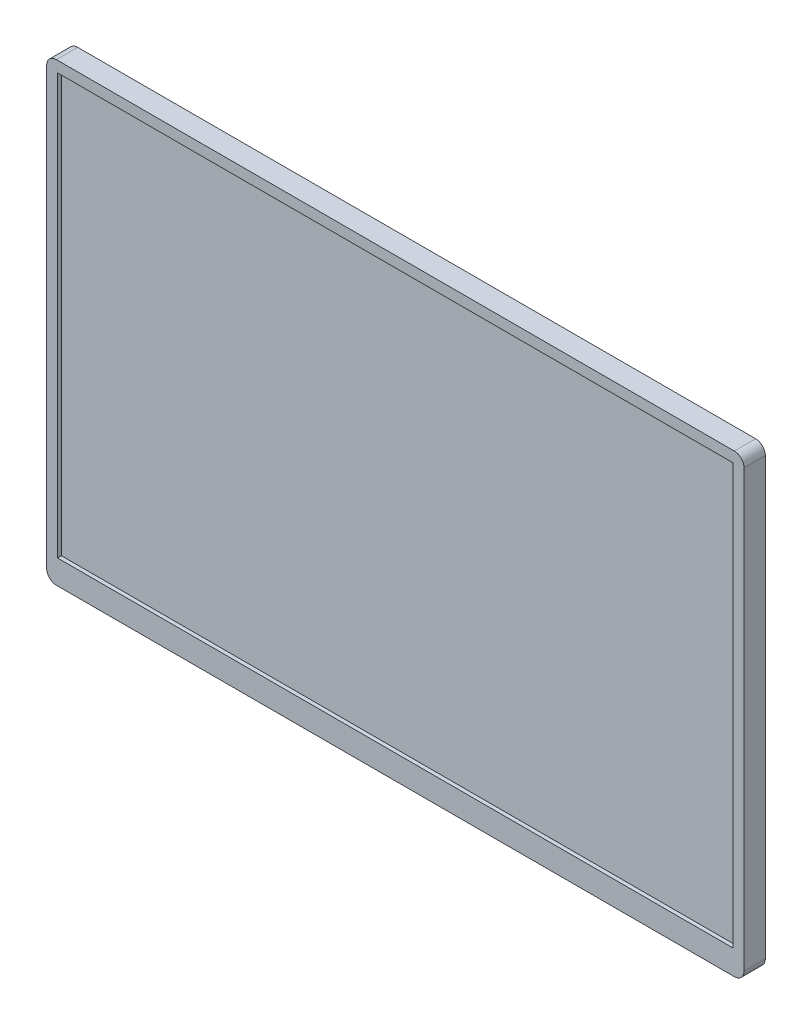
ISO-10303-21;
HEADER;
FILE_DESCRIPTION(('STEP AP214'),'2;1');
FILE_NAME('part.step','',(''),(''),'','','');
FILE_SCHEMA(('AUTOMOTIVE_DESIGN { 1 0 10303 214 1 1 1 1 }'));
ENDSEC;
DATA;
#1=APPLICATION_CONTEXT('core data for automotive mechanical design processes');
#2=APPLICATION_PROTOCOL_DEFINITION('international standard','automotive_design',2000,#1);
#3=PRODUCT_CONTEXT('',#1,'mechanical');
#4=PRODUCT('Part','Part','',(#3));
#5=PRODUCT_RELATED_PRODUCT_CATEGORY('part','',(#4));
#6=PRODUCT_DEFINITION_FORMATION('','',#4);
#7=PRODUCT_DEFINITION_CONTEXT('part definition',#1,'design');
#8=PRODUCT_DEFINITION('design','',#6,#7);
#9=PRODUCT_DEFINITION_SHAPE('','',#8);
#10=(LENGTH_UNIT() NAMED_UNIT(*) SI_UNIT(.MILLI.,.METRE.));
#11=(NAMED_UNIT(*) PLANE_ANGLE_UNIT() SI_UNIT($,.RADIAN.));
#12=(NAMED_UNIT(*) SI_UNIT($,.STERADIAN.) SOLID_ANGLE_UNIT());
#13=UNCERTAINTY_MEASURE_WITH_UNIT(LENGTH_MEASURE(1.E-05),#10,'distance_accuracy_value','');
#14=(GEOMETRIC_REPRESENTATION_CONTEXT(3) GLOBAL_UNCERTAINTY_ASSIGNED_CONTEXT((#13)) GLOBAL_UNIT_ASSIGNED_CONTEXT((#10,
#11,#12)) REPRESENTATION_CONTEXT('',''));
#15=CARTESIAN_POINT('',(0.,0.,0.));
#16=DIRECTION('',(0.,0.,1.));
#17=DIRECTION('',(1.,0.,0.));
#18=AXIS2_PLACEMENT_3D('',#15,#16,#17);
#19=CARTESIAN_POINT('',(180.,117.5,11.));
#20=DIRECTION('',(-1.,0.,0.));
#21=DIRECTION('',(0.,-1.,0.));
#22=AXIS2_PLACEMENT_3D('',#19,#20,#21);
#23=PLANE('',#22);
#24=DIRECTION('',(0.,1.,0.));
#25=VECTOR('',#24,1.);
#26=CARTESIAN_POINT('',(180.,117.5,11.));
#27=LINE('',#26,#25);
#28=CARTESIAN_POINT('',(180.,-112.5,11.));
#29=VERTEX_POINT('',#28);
#30=CARTESIAN_POINT('',(180.,112.5,11.));
#31=VERTEX_POINT('',#30);
#32=EDGE_CURVE('E162',#29,#31,#27,.T.);
#33=ORIENTED_EDGE('',*,*,#32,.F.);
#34=DIRECTION('',(0.,0.,-1.));
#35=VECTOR('',#34,1.);
#36=CARTESIAN_POINT('',(180.,-112.5,11.));
#37=LINE('',#36,#35);
#38=CARTESIAN_POINT('',(180.,-112.5,0.));
#39=VERTEX_POINT('',#38);
#40=EDGE_CURVE('E11',#29,#39,#37,.T.);
#41=ORIENTED_EDGE('',*,*,#40,.T.);
#42=DIRECTION('',(0.,1.,0.));
#43=VECTOR('',#42,1.);
#44=CARTESIAN_POINT('',(180.,117.5,0.));
#45=LINE('',#44,#43);
#46=CARTESIAN_POINT('',(180.,112.5,0.));
#47=VERTEX_POINT('',#46);
#48=EDGE_CURVE('E158',#39,#47,#45,.T.);
#49=ORIENTED_EDGE('',*,*,#48,.T.);
#50=DIRECTION('',(0.,0.,-1.));
#51=VECTOR('',#50,1.);
#52=CARTESIAN_POINT('',(180.,112.5,11.));
#53=LINE('',#52,#51);
#54=EDGE_CURVE('E40',#47,#31,#53,.F.);
#55=ORIENTED_EDGE('',*,*,#54,.T.);
#56=EDGE_LOOP('',(#33,#41,#49,#55));
#57=FACE_BOUND('',#56,.T.);
#58=ADVANCED_FACE('F32',(#57),#23,.F.);
#59=CARTESIAN_POINT('',(-180.,117.5,11.));
#60=DIRECTION('',(0.,-1.,0.));
#61=DIRECTION('',(0.,0.,-1.));
#62=AXIS2_PLACEMENT_3D('',#59,#60,#61);
#63=PLANE('',#62);
#64=DIRECTION('',(-1.,0.,0.));
#65=VECTOR('',#64,1.);
#66=CARTESIAN_POINT('',(-180.,117.5,0.));
#67=LINE('',#66,#65);
#68=CARTESIAN_POINT('',(175.,117.5,0.));
#69=VERTEX_POINT('',#68);
#70=CARTESIAN_POINT('',(-175.,117.5,0.));
#71=VERTEX_POINT('',#70);
#72=EDGE_CURVE('E177',#69,#71,#67,.T.);
#73=ORIENTED_EDGE('',*,*,#72,.T.);
#74=DIRECTION('',(0.,0.,-1.));
#75=VECTOR('',#74,1.);
#76=CARTESIAN_POINT('',(-175.,117.5,11.));
#77=LINE('',#76,#75);
#78=CARTESIAN_POINT('',(-175.,117.5,11.));
#79=VERTEX_POINT('',#78);
#80=EDGE_CURVE('E199',#71,#79,#77,.F.);
#81=ORIENTED_EDGE('',*,*,#80,.T.);
#82=DIRECTION('',(-1.,0.,0.));
#83=VECTOR('',#82,1.);
#84=CARTESIAN_POINT('',(-180.,117.5,11.));
#85=LINE('',#84,#83);
#86=CARTESIAN_POINT('',(175.,117.5,11.));
#87=VERTEX_POINT('',#86);
#88=EDGE_CURVE('E165',#87,#79,#85,.T.);
#89=ORIENTED_EDGE('',*,*,#88,.F.);
#90=DIRECTION('',(0.,0.,-1.));
#91=VECTOR('',#90,1.);
#92=CARTESIAN_POINT('',(175.,117.5,11.));
#93=LINE('',#92,#91);
#94=EDGE_CURVE('E196',#87,#69,#93,.T.);
#95=ORIENTED_EDGE('',*,*,#94,.T.);
#96=EDGE_LOOP('',(#73,#81,#89,#95));
#97=FACE_BOUND('',#96,.T.);
#98=ADVANCED_FACE('F226',(#97),#63,.F.);
#99=CARTESIAN_POINT('',(-180.,117.5,11.));
#100=DIRECTION('',(1.,0.,0.));
#101=DIRECTION('',(0.,1.,0.));
#102=AXIS2_PLACEMENT_3D('',#99,#100,#101);
#103=PLANE('',#102);
#104=DIRECTION('',(0.,-1.,0.));
#105=VECTOR('',#104,1.);
#106=CARTESIAN_POINT('',(-180.,117.5,11.));
#107=LINE('',#106,#105);
#108=CARTESIAN_POINT('',(-180.,112.5,11.));
#109=VERTEX_POINT('',#108);
#110=CARTESIAN_POINT('',(-180.,-112.5,11.));
#111=VERTEX_POINT('',#110);
#112=EDGE_CURVE('E169',#109,#111,#107,.T.);
#113=ORIENTED_EDGE('',*,*,#112,.F.);
#114=DIRECTION('',(0.,0.,-1.));
#115=VECTOR('',#114,1.);
#116=CARTESIAN_POINT('',(-180.,112.5,11.));
#117=LINE('',#116,#115);
#118=CARTESIAN_POINT('',(-180.,112.5,0.));
#119=VERTEX_POINT('',#118);
#120=EDGE_CURVE('E185',#109,#119,#117,.T.);
#121=ORIENTED_EDGE('',*,*,#120,.T.);
#122=DIRECTION('',(0.,-1.,0.));
#123=VECTOR('',#122,1.);
#124=CARTESIAN_POINT('',(-180.,117.5,0.));
#125=LINE('',#124,#123);
#126=CARTESIAN_POINT('',(-180.,-112.5,0.));
#127=VERTEX_POINT('',#126);
#128=EDGE_CURVE('E180',#119,#127,#125,.T.);
#129=ORIENTED_EDGE('',*,*,#128,.T.);
#130=DIRECTION('',(0.,0.,-1.));
#131=VECTOR('',#130,1.);
#132=CARTESIAN_POINT('',(-180.,-112.5,11.));
#133=LINE('',#132,#131);
#134=EDGE_CURVE('E174',#127,#111,#133,.F.);
#135=ORIENTED_EDGE('',*,*,#134,.T.);
#136=EDGE_LOOP('',(#113,#121,#129,#135));
#137=FACE_BOUND('',#136,.T.);
#138=ADVANCED_FACE('F237',(#137),#103,.F.);
#139=CARTESIAN_POINT('',(-180.,-117.5,11.));
#140=DIRECTION('',(0.,1.,0.));
#141=DIRECTION('',(0.,0.,1.));
#142=AXIS2_PLACEMENT_3D('',#139,#140,#141);
#143=PLANE('',#142);
#144=DIRECTION('',(1.,0.,0.));
#145=VECTOR('',#144,1.);
#146=CARTESIAN_POINT('',(-180.,-117.5,11.));
#147=LINE('',#146,#145);
#148=CARTESIAN_POINT('',(-175.,-117.5,11.));
#149=VERTEX_POINT('',#148);
#150=CARTESIAN_POINT('',(175.,-117.5,11.));
#151=VERTEX_POINT('',#150);
#152=EDGE_CURVE('E172',#149,#151,#147,.T.);
#153=ORIENTED_EDGE('',*,*,#152,.F.);
#154=DIRECTION('',(0.,0.,-1.));
#155=VECTOR('',#154,1.);
#156=CARTESIAN_POINT('',(-175.,-117.5,11.));
#157=LINE('',#156,#155);
#158=CARTESIAN_POINT('',(-175.,-117.5,0.));
#159=VERTEX_POINT('',#158);
#160=EDGE_CURVE('E210',#149,#159,#157,.T.);
#161=ORIENTED_EDGE('',*,*,#160,.T.);
#162=DIRECTION('',(1.,0.,0.));
#163=VECTOR('',#162,1.);
#164=CARTESIAN_POINT('',(-180.,-117.5,0.));
#165=LINE('',#164,#163);
#166=CARTESIAN_POINT('',(175.,-117.5,0.));
#167=VERTEX_POINT('',#166);
#168=EDGE_CURVE('E166',#159,#167,#165,.T.);
#169=ORIENTED_EDGE('',*,*,#168,.T.);
#170=DIRECTION('',(0.,0.,-1.));
#171=VECTOR('',#170,1.);
#172=CARTESIAN_POINT('',(175.,-117.5,11.));
#173=LINE('',#172,#171);
#174=EDGE_CURVE('E55',#167,#151,#173,.F.);
#175=ORIENTED_EDGE('',*,*,#174,.T.);
#176=EDGE_LOOP('',(#153,#161,#169,#175));
#177=FACE_BOUND('',#176,.T.);
#178=ADVANCED_FACE('F244',(#177),#143,.F.);
#179=CARTESIAN_POINT('',(0.,0.,11.));
#180=DIRECTION('',(0.,0.,1.));
#181=DIRECTION('',(1.,0.,0.));
#182=AXIS2_PLACEMENT_3D('',#179,#180,#181);
#183=PLANE('',#182);
#184=DIRECTION('',(0.,-1.,0.));
#185=VECTOR('',#184,1.);
#186=CARTESIAN_POINT('',(-174.4,111.9,11.));
#187=LINE('',#186,#185);
#188=CARTESIAN_POINT('',(-174.4,111.9,11.));
#189=VERTEX_POINT('',#188);
#190=CARTESIAN_POINT('',(-174.4,-105.,11.));
#191=VERTEX_POINT('',#190);
#192=EDGE_CURVE('E47',#189,#191,#187,.T.);
#193=ORIENTED_EDGE('',*,*,#192,.F.);
#194=DIRECTION('',(-1.,0.,0.));
#195=VECTOR('',#194,1.);
#196=CARTESIAN_POINT('',(-174.4,111.9,11.));
#197=LINE('',#196,#195);
#198=CARTESIAN_POINT('',(174.4,111.9,11.));
#199=VERTEX_POINT('',#198);
#200=EDGE_CURVE('E143',#199,#189,#197,.T.);
#201=ORIENTED_EDGE('',*,*,#200,.F.);
#202=DIRECTION('',(0.,1.,0.));
#203=VECTOR('',#202,1.);
#204=CARTESIAN_POINT('',(174.4,111.9,11.));
#205=LINE('',#204,#203);
#206=CARTESIAN_POINT('',(174.4,-105.,11.));
#207=VERTEX_POINT('',#206);
#208=EDGE_CURVE('E146',#207,#199,#205,.T.);
#209=ORIENTED_EDGE('',*,*,#208,.F.);
#210=DIRECTION('',(1.,0.,0.));
#211=VECTOR('',#210,1.);
#212=CARTESIAN_POINT('',(-174.4,-105.,11.));
#213=LINE('',#212,#211);
#214=EDGE_CURVE('E152',#191,#207,#213,.T.);
#215=ORIENTED_EDGE('',*,*,#214,.F.);
#216=EDGE_LOOP('',(#193,#201,#209,#215));
#217=FACE_BOUND('',#216,.T.);
#218=ORIENTED_EDGE('',*,*,#88,.T.);
#219=CARTESIAN_POINT('',(-175.,112.5,11.));
#220=DIRECTION('',(0.,0.,1.));
#221=DIRECTION('',(1.,0.,0.));
#222=AXIS2_PLACEMENT_3D('',#219,#220,#221);
#223=CIRCLE('',#222,5.);
#224=EDGE_CURVE('E207',#79,#109,#223,.T.);
#225=ORIENTED_EDGE('',*,*,#224,.T.);
#226=ORIENTED_EDGE('',*,*,#112,.T.);
#227=CARTESIAN_POINT('',(-175.,-112.5,11.));
#228=DIRECTION('',(0.,0.,1.));
#229=DIRECTION('',(1.,0.,0.));
#230=AXIS2_PLACEMENT_3D('',#227,#228,#229);
#231=CIRCLE('',#230,5.);
#232=EDGE_CURVE('E205',#111,#149,#231,.T.);
#233=ORIENTED_EDGE('',*,*,#232,.T.);
#234=ORIENTED_EDGE('',*,*,#152,.T.);
#235=CARTESIAN_POINT('',(175.,-112.5,11.));
#236=DIRECTION('',(0.,0.,1.));
#237=DIRECTION('',(1.,0.,0.));
#238=AXIS2_PLACEMENT_3D('',#235,#236,#237);
#239=CIRCLE('',#238,5.);
#240=EDGE_CURVE('E203',#151,#29,#239,.T.);
#241=ORIENTED_EDGE('',*,*,#240,.T.);
#242=ORIENTED_EDGE('',*,*,#32,.T.);
#243=CARTESIAN_POINT('',(175.,112.5,11.));
#244=DIRECTION('',(0.,0.,1.));
#245=DIRECTION('',(1.,0.,0.));
#246=AXIS2_PLACEMENT_3D('',#243,#244,#245);
#247=CIRCLE('',#246,5.);
#248=EDGE_CURVE('E201',#31,#87,#247,.T.);
#249=ORIENTED_EDGE('',*,*,#248,.T.);
#250=EDGE_LOOP('',(#218,#225,#226,#233,#234,#241,#242,#249));
#251=FACE_BOUND('',#250,.T.);
#252=ADVANCED_FACE('F220',(#217,#251),#183,.T.);
#253=CARTESIAN_POINT('',(0.,0.,0.));
#254=DIRECTION('',(0.,0.,1.));
#255=DIRECTION('',(1.,0.,0.));
#256=AXIS2_PLACEMENT_3D('',#253,#254,#255);
#257=PLANE('',#256);
#258=ORIENTED_EDGE('',*,*,#128,.F.);
#259=CARTESIAN_POINT('',(-175.,112.5,0.));
#260=DIRECTION('',(0.,0.,1.));
#261=DIRECTION('',(1.,0.,0.));
#262=AXIS2_PLACEMENT_3D('',#259,#260,#261);
#263=CIRCLE('',#262,5.);
#264=EDGE_CURVE('E194',#119,#71,#263,.F.);
#265=ORIENTED_EDGE('',*,*,#264,.T.);
#266=ORIENTED_EDGE('',*,*,#72,.F.);
#267=CARTESIAN_POINT('',(175.,112.5,0.));
#268=DIRECTION('',(0.,0.,1.));
#269=DIRECTION('',(1.,0.,0.));
#270=AXIS2_PLACEMENT_3D('',#267,#268,#269);
#271=CIRCLE('',#270,5.);
#272=EDGE_CURVE('E188',#69,#47,#271,.F.);
#273=ORIENTED_EDGE('',*,*,#272,.T.);
#274=ORIENTED_EDGE('',*,*,#48,.F.);
#275=CARTESIAN_POINT('',(175.,-112.5,0.));
#276=DIRECTION('',(0.,0.,1.));
#277=DIRECTION('',(1.,0.,0.));
#278=AXIS2_PLACEMENT_3D('',#275,#276,#277);
#279=CIRCLE('',#278,5.);
#280=EDGE_CURVE('E190',#39,#167,#279,.F.);
#281=ORIENTED_EDGE('',*,*,#280,.T.);
#282=ORIENTED_EDGE('',*,*,#168,.F.);
#283=CARTESIAN_POINT('',(-175.,-112.5,0.));
#284=DIRECTION('',(0.,0.,1.));
#285=DIRECTION('',(1.,0.,0.));
#286=AXIS2_PLACEMENT_3D('',#283,#284,#285);
#287=CIRCLE('',#286,5.);
#288=EDGE_CURVE('E192',#159,#127,#287,.F.);
#289=ORIENTED_EDGE('',*,*,#288,.T.);
#290=EDGE_LOOP('',(#258,#265,#266,#273,#274,#281,#282,#289));
#291=FACE_BOUND('',#290,.T.);
#292=ADVANCED_FACE('F230',(#291),#257,.F.);
#293=CARTESIAN_POINT('',(-175.,112.5,11.));
#294=DIRECTION('',(0.,0.,-1.));
#295=DIRECTION('',(-1.,0.,0.));
#296=AXIS2_PLACEMENT_3D('',#293,#294,#295);
#297=CYLINDRICAL_SURFACE('',#296,5.);
#298=ORIENTED_EDGE('',*,*,#224,.F.);
#299=ORIENTED_EDGE('',*,*,#80,.F.);
#300=ORIENTED_EDGE('',*,*,#264,.F.);
#301=ORIENTED_EDGE('',*,*,#120,.F.);
#302=EDGE_LOOP('',(#298,#299,#300,#301));
#303=FACE_BOUND('',#302,.T.);
#304=ADVANCED_FACE('F234',(#303),#297,.T.);
#305=CARTESIAN_POINT('',(-175.,-112.5,11.));
#306=DIRECTION('',(0.,0.,-1.));
#307=DIRECTION('',(-1.,0.,0.));
#308=AXIS2_PLACEMENT_3D('',#305,#306,#307);
#309=CYLINDRICAL_SURFACE('',#308,5.);
#310=ORIENTED_EDGE('',*,*,#232,.F.);
#311=ORIENTED_EDGE('',*,*,#134,.F.);
#312=ORIENTED_EDGE('',*,*,#288,.F.);
#313=ORIENTED_EDGE('',*,*,#160,.F.);
#314=EDGE_LOOP('',(#310,#311,#312,#313));
#315=FACE_BOUND('',#314,.T.);
#316=ADVANCED_FACE('F242',(#315),#309,.T.);
#317=CARTESIAN_POINT('',(175.,-112.5,11.));
#318=DIRECTION('',(0.,0.,-1.));
#319=DIRECTION('',(-1.,0.,0.));
#320=AXIS2_PLACEMENT_3D('',#317,#318,#319);
#321=CYLINDRICAL_SURFACE('',#320,5.);
#322=ORIENTED_EDGE('',*,*,#240,.F.);
#323=ORIENTED_EDGE('',*,*,#174,.F.);
#324=ORIENTED_EDGE('',*,*,#280,.F.);
#325=ORIENTED_EDGE('',*,*,#40,.F.);
#326=EDGE_LOOP('',(#322,#323,#324,#325));
#327=FACE_BOUND('',#326,.T.);
#328=ADVANCED_FACE('F246',(#327),#321,.T.);
#329=CARTESIAN_POINT('',(175.,112.5,11.));
#330=DIRECTION('',(0.,0.,-1.));
#331=DIRECTION('',(-1.,0.,0.));
#332=AXIS2_PLACEMENT_3D('',#329,#330,#331);
#333=CYLINDRICAL_SURFACE('',#332,5.);
#334=ORIENTED_EDGE('',*,*,#248,.F.);
#335=ORIENTED_EDGE('',*,*,#54,.F.);
#336=ORIENTED_EDGE('',*,*,#272,.F.);
#337=ORIENTED_EDGE('',*,*,#94,.F.);
#338=EDGE_LOOP('',(#334,#335,#336,#337));
#339=FACE_BOUND('',#338,.T.);
#340=ADVANCED_FACE('F34',(#339),#333,.T.);
#341=CARTESIAN_POINT('',(-174.4,111.9,9.));
#342=DIRECTION('',(-1.,0.,0.));
#343=DIRECTION('',(0.,-1.,0.));
#344=AXIS2_PLACEMENT_3D('',#341,#342,#343);
#345=PLANE('',#344);
#346=ORIENTED_EDGE('',*,*,#192,.T.);
#347=DIRECTION('',(0.,0.,1.));
#348=VECTOR('',#347,1.);
#349=CARTESIAN_POINT('',(-174.4,-105.,9.));
#350=LINE('',#349,#348);
#351=CARTESIAN_POINT('',(-174.4,-105.,9.));
#352=VERTEX_POINT('',#351);
#353=EDGE_CURVE('E121',#352,#191,#350,.T.);
#354=ORIENTED_EDGE('',*,*,#353,.F.);
#355=DIRECTION('',(0.,-1.,0.));
#356=VECTOR('',#355,1.);
#357=CARTESIAN_POINT('',(-174.4,111.9,9.));
#358=LINE('',#357,#356);
#359=CARTESIAN_POINT('',(-174.4,111.9,9.));
#360=VERTEX_POINT('',#359);
#361=EDGE_CURVE('E125',#360,#352,#358,.T.);
#362=ORIENTED_EDGE('',*,*,#361,.F.);
#363=DIRECTION('',(0.,0.,1.));
#364=VECTOR('',#363,1.);
#365=CARTESIAN_POINT('',(-174.4,111.9,9.));
#366=LINE('',#365,#364);
#367=EDGE_CURVE('E156',#360,#189,#366,.T.);
#368=ORIENTED_EDGE('',*,*,#367,.T.);
#369=EDGE_LOOP('',(#346,#354,#362,#368));
#370=FACE_BOUND('',#369,.T.);
#371=ADVANCED_FACE('F123',(#370),#345,.F.);
#372=CARTESIAN_POINT('',(-174.4,111.9,9.));
#373=DIRECTION('',(0.,1.,0.));
#374=DIRECTION('',(0.,0.,1.));
#375=AXIS2_PLACEMENT_3D('',#372,#373,#374);
#376=PLANE('',#375);
#377=ORIENTED_EDGE('',*,*,#200,.T.);
#378=ORIENTED_EDGE('',*,*,#367,.F.);
#379=DIRECTION('',(-1.,0.,0.));
#380=VECTOR('',#379,1.);
#381=CARTESIAN_POINT('',(-174.4,111.9,9.));
#382=LINE('',#381,#380);
#383=CARTESIAN_POINT('',(174.4,111.9,9.));
#384=VERTEX_POINT('',#383);
#385=EDGE_CURVE('E131',#384,#360,#382,.T.);
#386=ORIENTED_EDGE('',*,*,#385,.F.);
#387=DIRECTION('',(0.,0.,1.));
#388=VECTOR('',#387,1.);
#389=CARTESIAN_POINT('',(174.4,111.9,9.));
#390=LINE('',#389,#388);
#391=EDGE_CURVE('E159',#384,#199,#390,.T.);
#392=ORIENTED_EDGE('',*,*,#391,.T.);
#393=EDGE_LOOP('',(#377,#378,#386,#392));
#394=FACE_BOUND('',#393,.T.);
#395=ADVANCED_FACE('F300',(#394),#376,.F.);
#396=CARTESIAN_POINT('',(174.4,111.9,9.));
#397=DIRECTION('',(1.,0.,0.));
#398=DIRECTION('',(0.,1.,0.));
#399=AXIS2_PLACEMENT_3D('',#396,#397,#398);
#400=PLANE('',#399);
#401=ORIENTED_EDGE('',*,*,#208,.T.);
#402=ORIENTED_EDGE('',*,*,#391,.F.);
#403=DIRECTION('',(0.,1.,0.));
#404=VECTOR('',#403,1.);
#405=CARTESIAN_POINT('',(174.4,111.9,9.));
#406=LINE('',#405,#404);
#407=CARTESIAN_POINT('',(174.4,-105.,9.));
#408=VERTEX_POINT('',#407);
#409=EDGE_CURVE('E139',#408,#384,#406,.T.);
#410=ORIENTED_EDGE('',*,*,#409,.F.);
#411=DIRECTION('',(0.,0.,1.));
#412=VECTOR('',#411,1.);
#413=CARTESIAN_POINT('',(174.4,-105.,9.));
#414=LINE('',#413,#412);
#415=EDGE_CURVE('E130',#408,#207,#414,.T.);
#416=ORIENTED_EDGE('',*,*,#415,.T.);
#417=EDGE_LOOP('',(#401,#402,#410,#416));
#418=FACE_BOUND('',#417,.T.);
#419=ADVANCED_FACE('F308',(#418),#400,.F.);
#420=CARTESIAN_POINT('',(-174.4,-105.,9.));
#421=DIRECTION('',(0.,-1.,0.));
#422=DIRECTION('',(0.,0.,-1.));
#423=AXIS2_PLACEMENT_3D('',#420,#421,#422);
#424=PLANE('',#423);
#425=ORIENTED_EDGE('',*,*,#214,.T.);
#426=ORIENTED_EDGE('',*,*,#415,.F.);
#427=DIRECTION('',(1.,0.,0.));
#428=VECTOR('',#427,1.);
#429=CARTESIAN_POINT('',(-174.4,-105.,9.));
#430=LINE('',#429,#428);
#431=EDGE_CURVE('E134',#352,#408,#430,.T.);
#432=ORIENTED_EDGE('',*,*,#431,.F.);
#433=ORIENTED_EDGE('',*,*,#353,.T.);
#434=EDGE_LOOP('',(#425,#426,#432,#433));
#435=FACE_BOUND('',#434,.T.);
#436=ADVANCED_FACE('F135',(#435),#424,.F.);
#437=CARTESIAN_POINT('',(0.,0.,9.));
#438=DIRECTION('',(0.,0.,1.));
#439=DIRECTION('',(1.,0.,0.));
#440=AXIS2_PLACEMENT_3D('',#437,#438,#439);
#441=PLANE('',#440);
#442=ORIENTED_EDGE('',*,*,#361,.T.);
#443=ORIENTED_EDGE('',*,*,#431,.T.);
#444=ORIENTED_EDGE('',*,*,#409,.T.);
#445=ORIENTED_EDGE('',*,*,#385,.T.);
#446=EDGE_LOOP('',(#442,#443,#444,#445));
#447=FACE_BOUND('',#446,.T.);
#448=ADVANCED_FACE('F141',(#447),#441,.T.);
#449=CLOSED_SHELL('',(#58,#98,#138,#178,#252,#292,#304,#316,#328,#340,#371,#395,#419,#436,#448));
#450=MANIFOLD_SOLID_BREP('B2',#449);
#451=ADVANCED_BREP_SHAPE_REPRESENTATION('',(#18,#450),#14);
#452=SHAPE_DEFINITION_REPRESENTATION(#9,#451);
ENDSEC;
END-ISO-10303-21;
